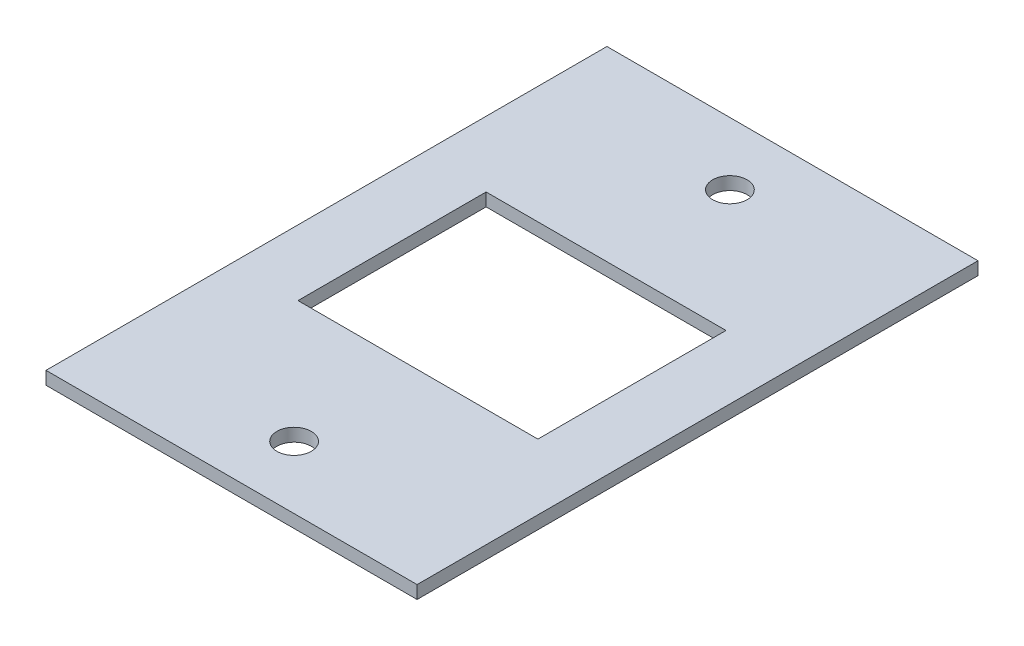
ISO-10303-21;
HEADER;
FILE_DESCRIPTION(('STEP AP214'),'2;1');
FILE_NAME('part.step','',(''),(''),'','','');
FILE_SCHEMA(('AUTOMOTIVE_DESIGN { 1 0 10303 214 1 1 1 1 }'));
ENDSEC;
DATA;
#1=APPLICATION_CONTEXT('core data for automotive mechanical design processes');
#2=APPLICATION_PROTOCOL_DEFINITION('international standard','automotive_design',2000,#1);
#3=PRODUCT_CONTEXT('',#1,'mechanical');
#4=PRODUCT('Part','Part','',(#3));
#5=PRODUCT_RELATED_PRODUCT_CATEGORY('part','',(#4));
#6=PRODUCT_DEFINITION_FORMATION('','',#4);
#7=PRODUCT_DEFINITION_CONTEXT('part definition',#1,'design');
#8=PRODUCT_DEFINITION('design','',#6,#7);
#9=PRODUCT_DEFINITION_SHAPE('','',#8);
#10=(LENGTH_UNIT() NAMED_UNIT(*) SI_UNIT(.MILLI.,.METRE.));
#11=(NAMED_UNIT(*) PLANE_ANGLE_UNIT() SI_UNIT($,.RADIAN.));
#12=(NAMED_UNIT(*) SI_UNIT($,.STERADIAN.) SOLID_ANGLE_UNIT());
#13=UNCERTAINTY_MEASURE_WITH_UNIT(LENGTH_MEASURE(1.E-05),#10,'distance_accuracy_value','');
#14=(GEOMETRIC_REPRESENTATION_CONTEXT(3) GLOBAL_UNCERTAINTY_ASSIGNED_CONTEXT((#13)) GLOBAL_UNIT_ASSIGNED_CONTEXT((#10,
#11,#12)) REPRESENTATION_CONTEXT('',''));
#15=CARTESIAN_POINT('',(0.,0.,0.));
#16=DIRECTION('',(0.,0.,1.));
#17=DIRECTION('',(1.,0.,0.));
#18=AXIS2_PLACEMENT_3D('',#15,#16,#17);
#19=CARTESIAN_POINT('',(0.,1.5,0.));
#20=DIRECTION('',(0.,-1.,0.));
#21=DIRECTION('',(0.,0.,-1.));
#22=AXIS2_PLACEMENT_3D('',#19,#20,#21);
#23=PLANE('',#22);
#24=CARTESIAN_POINT('',(21.5,1.5,-57.75));
#25=DIRECTION('',(0.,1.,0.));
#26=DIRECTION('',(0.,0.,-1.));
#27=AXIS2_PLACEMENT_3D('',#24,#25,#26);
#28=CIRCLE('',#27,2.00000000000001);
#29=CARTESIAN_POINT('',(21.5,1.5,-59.75));
#30=VERTEX_POINT('',#29);
#31=EDGE_CURVE('E153',#30,#30,#28,.T.);
#32=ORIENTED_EDGE('',*,*,#31,.F.);
#33=EDGE_LOOP('',(#32));
#34=FACE_BOUND('',#33,.T.);
#35=CARTESIAN_POINT('',(21.5,1.5,-7.25));
#36=DIRECTION('',(0.,1.,0.));
#37=DIRECTION('',(0.,0.,1.));
#38=AXIS2_PLACEMENT_3D('',#35,#36,#37);
#39=CIRCLE('',#38,2.00000000000001);
#40=CARTESIAN_POINT('',(21.5,1.5,-5.24999999999999));
#41=VERTEX_POINT('',#40);
#42=EDGE_CURVE('E161',#41,#41,#39,.T.);
#43=ORIENTED_EDGE('',*,*,#42,.F.);
#44=EDGE_LOOP('',(#43));
#45=FACE_BOUND('',#44,.T.);
#46=DIRECTION('',(0.,0.,1.));
#47=VECTOR('',#46,1.);
#48=CARTESIAN_POINT('',(0.,1.5,0.));
#49=LINE('',#48,#47);
#50=CARTESIAN_POINT('',(0.,1.5,-65.));
#51=VERTEX_POINT('',#50);
#52=CARTESIAN_POINT('',(0.,1.5,0.));
#53=VERTEX_POINT('',#52);
#54=EDGE_CURVE('E169',#51,#53,#49,.T.);
#55=ORIENTED_EDGE('',*,*,#54,.T.);
#56=DIRECTION('',(1.,0.,0.));
#57=VECTOR('',#56,1.);
#58=CARTESIAN_POINT('',(0.,1.5,0.));
#59=LINE('',#58,#57);
#60=CARTESIAN_POINT('',(43.,1.5,0.));
#61=VERTEX_POINT('',#60);
#62=EDGE_CURVE('E173',#53,#61,#59,.T.);
#63=ORIENTED_EDGE('',*,*,#62,.T.);
#64=DIRECTION('',(0.,0.,-1.));
#65=VECTOR('',#64,1.);
#66=CARTESIAN_POINT('',(43.,1.5,0.));
#67=LINE('',#66,#65);
#68=CARTESIAN_POINT('',(43.,1.5,-65.));
#69=VERTEX_POINT('',#68);
#70=EDGE_CURVE('E177',#61,#69,#67,.T.);
#71=ORIENTED_EDGE('',*,*,#70,.T.);
#72=DIRECTION('',(-1.,0.,0.));
#73=VECTOR('',#72,1.);
#74=CARTESIAN_POINT('',(0.,1.5,-65.));
#75=LINE('',#74,#73);
#76=EDGE_CURVE('E180',#69,#51,#75,.T.);
#77=ORIENTED_EDGE('',*,*,#76,.T.);
#78=EDGE_LOOP('',(#55,#63,#71,#77));
#79=FACE_BOUND('',#78,.T.);
#80=DIRECTION('',(0.,0.,-1.));
#81=VECTOR('',#80,1.);
#82=CARTESIAN_POINT('',(35.4,1.5,-43.4));
#83=LINE('',#82,#81);
#84=CARTESIAN_POINT('',(35.4,1.5,-21.6));
#85=VERTEX_POINT('',#84);
#86=CARTESIAN_POINT('',(35.4,1.5,-43.4));
#87=VERTEX_POINT('',#86);
#88=EDGE_CURVE('E105',#85,#87,#83,.T.);
#89=ORIENTED_EDGE('',*,*,#88,.F.);
#90=DIRECTION('',(1.,0.,0.));
#91=VECTOR('',#90,1.);
#92=CARTESIAN_POINT('',(7.59999999999999,1.5,-21.6));
#93=LINE('',#92,#91);
#94=CARTESIAN_POINT('',(7.59999999999999,1.5,-21.6));
#95=VERTEX_POINT('',#94);
#96=EDGE_CURVE('E131',#95,#85,#93,.T.);
#97=ORIENTED_EDGE('',*,*,#96,.F.);
#98=DIRECTION('',(0.,0.,1.));
#99=VECTOR('',#98,1.);
#100=CARTESIAN_POINT('',(7.59999999999999,1.5,-43.4));
#101=LINE('',#100,#99);
#102=CARTESIAN_POINT('',(7.59999999999999,1.5,-43.4));
#103=VERTEX_POINT('',#102);
#104=EDGE_CURVE('E127',#103,#95,#101,.T.);
#105=ORIENTED_EDGE('',*,*,#104,.F.);
#106=DIRECTION('',(-1.,0.,0.));
#107=VECTOR('',#106,1.);
#108=CARTESIAN_POINT('',(7.59999999999999,1.5,-43.4));
#109=LINE('',#108,#107);
#110=EDGE_CURVE('E114',#87,#103,#109,.T.);
#111=ORIENTED_EDGE('',*,*,#110,.F.);
#112=EDGE_LOOP('',(#89,#97,#105,#111));
#113=FACE_BOUND('',#112,.T.);
#114=ADVANCED_FACE('F39',(#34,#45,#79,#113),#23,.F.);
#115=CARTESIAN_POINT('',(0.,0.,0.));
#116=DIRECTION('',(0.,-1.,0.));
#117=DIRECTION('',(0.,0.,-1.));
#118=AXIS2_PLACEMENT_3D('',#115,#116,#117);
#119=PLANE('',#118);
#120=CARTESIAN_POINT('',(21.5,0.,-7.25));
#121=DIRECTION('',(0.,1.,0.));
#122=DIRECTION('',(0.,0.,1.));
#123=AXIS2_PLACEMENT_3D('',#120,#121,#122);
#124=CIRCLE('',#123,2.00000000000001);
#125=CARTESIAN_POINT('',(21.5,0.,-5.24999999999999));
#126=VERTEX_POINT('',#125);
#127=EDGE_CURVE('E157',#126,#126,#124,.T.);
#128=ORIENTED_EDGE('',*,*,#127,.T.);
#129=EDGE_LOOP('',(#128));
#130=FACE_BOUND('',#129,.T.);
#131=DIRECTION('',(0.,0.,1.));
#132=VECTOR('',#131,1.);
#133=CARTESIAN_POINT('',(0.,0.,0.));
#134=LINE('',#133,#132);
#135=CARTESIAN_POINT('',(0.,0.,-65.));
#136=VERTEX_POINT('',#135);
#137=CARTESIAN_POINT('',(0.,0.,0.));
#138=VERTEX_POINT('',#137);
#139=EDGE_CURVE('E165',#136,#138,#134,.T.);
#140=ORIENTED_EDGE('',*,*,#139,.F.);
#141=DIRECTION('',(-1.,0.,0.));
#142=VECTOR('',#141,1.);
#143=CARTESIAN_POINT('',(0.,0.,-65.));
#144=LINE('',#143,#142);
#145=CARTESIAN_POINT('',(43.,0.,-65.));
#146=VERTEX_POINT('',#145);
#147=EDGE_CURVE('E174',#146,#136,#144,.T.);
#148=ORIENTED_EDGE('',*,*,#147,.F.);
#149=DIRECTION('',(0.,0.,-1.));
#150=VECTOR('',#149,1.);
#151=CARTESIAN_POINT('',(43.,0.,0.));
#152=LINE('',#151,#150);
#153=CARTESIAN_POINT('',(43.,0.,0.));
#154=VERTEX_POINT('',#153);
#155=EDGE_CURVE('E190',#154,#146,#152,.T.);
#156=ORIENTED_EDGE('',*,*,#155,.F.);
#157=DIRECTION('',(1.,0.,0.));
#158=VECTOR('',#157,1.);
#159=CARTESIAN_POINT('',(0.,0.,0.));
#160=LINE('',#159,#158);
#161=EDGE_CURVE('E187',#138,#154,#160,.T.);
#162=ORIENTED_EDGE('',*,*,#161,.F.);
#163=EDGE_LOOP('',(#140,#148,#156,#162));
#164=FACE_BOUND('',#163,.T.);
#165=CARTESIAN_POINT('',(21.5,0.,-57.75));
#166=DIRECTION('',(0.,1.,0.));
#167=DIRECTION('',(0.,0.,-1.));
#168=AXIS2_PLACEMENT_3D('',#165,#166,#167);
#169=CIRCLE('',#168,2.00000000000001);
#170=CARTESIAN_POINT('',(21.5,0.,-59.75));
#171=VERTEX_POINT('',#170);
#172=EDGE_CURVE('E123',#171,#171,#169,.T.);
#173=ORIENTED_EDGE('',*,*,#172,.T.);
#174=EDGE_LOOP('',(#173));
#175=FACE_BOUND('',#174,.T.);
#176=DIRECTION('',(1.,0.,0.));
#177=VECTOR('',#176,1.);
#178=CARTESIAN_POINT('',(7.59999999999999,0.,-21.6));
#179=LINE('',#178,#177);
#180=CARTESIAN_POINT('',(7.59999999999999,0.,-21.6));
#181=VERTEX_POINT('',#180);
#182=CARTESIAN_POINT('',(35.4,0.,-21.6));
#183=VERTEX_POINT('',#182);
#184=EDGE_CURVE('E115',#181,#183,#179,.T.);
#185=ORIENTED_EDGE('',*,*,#184,.T.);
#186=DIRECTION('',(0.,0.,-1.));
#187=VECTOR('',#186,1.);
#188=CARTESIAN_POINT('',(35.4,0.,-43.4));
#189=LINE('',#188,#187);
#190=CARTESIAN_POINT('',(35.4,0.,-43.4));
#191=VERTEX_POINT('',#190);
#192=EDGE_CURVE('E63',#183,#191,#189,.T.);
#193=ORIENTED_EDGE('',*,*,#192,.T.);
#194=DIRECTION('',(-1.,0.,0.));
#195=VECTOR('',#194,1.);
#196=CARTESIAN_POINT('',(7.59999999999999,0.,-43.4));
#197=LINE('',#196,#195);
#198=CARTESIAN_POINT('',(7.59999999999999,0.,-43.4));
#199=VERTEX_POINT('',#198);
#200=EDGE_CURVE('E121',#191,#199,#197,.T.);
#201=ORIENTED_EDGE('',*,*,#200,.T.);
#202=DIRECTION('',(0.,0.,1.));
#203=VECTOR('',#202,1.);
#204=CARTESIAN_POINT('',(7.59999999999999,0.,-43.4));
#205=LINE('',#204,#203);
#206=EDGE_CURVE('E140',#199,#181,#205,.T.);
#207=ORIENTED_EDGE('',*,*,#206,.T.);
#208=EDGE_LOOP('',(#185,#193,#201,#207));
#209=FACE_BOUND('',#208,.T.);
#210=ADVANCED_FACE('F213',(#130,#164,#175,#209),#119,.T.);
#211=CARTESIAN_POINT('',(0.,1.5,0.));
#212=DIRECTION('',(1.,0.,0.));
#213=DIRECTION('',(0.,0.,-1.));
#214=AXIS2_PLACEMENT_3D('',#211,#212,#213);
#215=PLANE('',#214);
#216=ORIENTED_EDGE('',*,*,#139,.T.);
#217=DIRECTION('',(0.,-1.,0.));
#218=VECTOR('',#217,1.);
#219=CARTESIAN_POINT('',(0.,1.5,0.));
#220=LINE('',#219,#218);
#221=EDGE_CURVE('E11',#53,#138,#220,.T.);
#222=ORIENTED_EDGE('',*,*,#221,.F.);
#223=ORIENTED_EDGE('',*,*,#54,.F.);
#224=DIRECTION('',(0.,-1.,0.));
#225=VECTOR('',#224,1.);
#226=CARTESIAN_POINT('',(0.,1.5,-65.));
#227=LINE('',#226,#225);
#228=EDGE_CURVE('E183',#51,#136,#227,.T.);
#229=ORIENTED_EDGE('',*,*,#228,.T.);
#230=EDGE_LOOP('',(#216,#222,#223,#229));
#231=FACE_BOUND('',#230,.T.);
#232=ADVANCED_FACE('F41',(#231),#215,.F.);
#233=CARTESIAN_POINT('',(0.,1.5,0.));
#234=DIRECTION('',(0.,0.,-1.));
#235=DIRECTION('',(-1.,0.,0.));
#236=AXIS2_PLACEMENT_3D('',#233,#234,#235);
#237=PLANE('',#236);
#238=ORIENTED_EDGE('',*,*,#161,.T.);
#239=DIRECTION('',(0.,-1.,0.));
#240=VECTOR('',#239,1.);
#241=CARTESIAN_POINT('',(43.,1.5,0.));
#242=LINE('',#241,#240);
#243=EDGE_CURVE('E48',#61,#154,#242,.T.);
#244=ORIENTED_EDGE('',*,*,#243,.F.);
#245=ORIENTED_EDGE('',*,*,#62,.F.);
#246=ORIENTED_EDGE('',*,*,#221,.T.);
#247=EDGE_LOOP('',(#238,#244,#245,#246));
#248=FACE_BOUND('',#247,.T.);
#249=ADVANCED_FACE('F223',(#248),#237,.F.);
#250=CARTESIAN_POINT('',(43.,1.5,0.));
#251=DIRECTION('',(-1.,0.,0.));
#252=DIRECTION('',(0.,0.,1.));
#253=AXIS2_PLACEMENT_3D('',#250,#251,#252);
#254=PLANE('',#253);
#255=ORIENTED_EDGE('',*,*,#155,.T.);
#256=DIRECTION('',(0.,-1.,0.));
#257=VECTOR('',#256,1.);
#258=CARTESIAN_POINT('',(43.,1.5,-65.));
#259=LINE('',#258,#257);
#260=EDGE_CURVE('E198',#69,#146,#259,.T.);
#261=ORIENTED_EDGE('',*,*,#260,.F.);
#262=ORIENTED_EDGE('',*,*,#70,.F.);
#263=ORIENTED_EDGE('',*,*,#243,.T.);
#264=EDGE_LOOP('',(#255,#261,#262,#263));
#265=FACE_BOUND('',#264,.T.);
#266=ADVANCED_FACE('F207',(#265),#254,.F.);
#267=CARTESIAN_POINT('',(0.,1.5,-65.));
#268=DIRECTION('',(0.,0.,1.));
#269=DIRECTION('',(1.,0.,0.));
#270=AXIS2_PLACEMENT_3D('',#267,#268,#269);
#271=PLANE('',#270);
#272=ORIENTED_EDGE('',*,*,#147,.T.);
#273=ORIENTED_EDGE('',*,*,#228,.F.);
#274=ORIENTED_EDGE('',*,*,#76,.F.);
#275=ORIENTED_EDGE('',*,*,#260,.T.);
#276=EDGE_LOOP('',(#272,#273,#274,#275));
#277=FACE_BOUND('',#276,.T.);
#278=ADVANCED_FACE('F217',(#277),#271,.F.);
#279=CARTESIAN_POINT('',(21.5,1.5,-7.25));
#280=DIRECTION('',(0.,-1.,0.));
#281=DIRECTION('',(0.,0.,-1.));
#282=AXIS2_PLACEMENT_3D('',#279,#280,#281);
#283=CYLINDRICAL_SURFACE('',#282,2.00000000000001);
#284=ORIENTED_EDGE('',*,*,#42,.T.);
#285=EDGE_LOOP('',(#284));
#286=FACE_BOUND('',#285,.T.);
#287=ORIENTED_EDGE('',*,*,#127,.F.);
#288=EDGE_LOOP('',(#287));
#289=FACE_BOUND('',#288,.T.);
#290=ADVANCED_FACE('F241',(#286,#289),#283,.F.);
#291=CARTESIAN_POINT('',(21.5,1.5,-57.75));
#292=DIRECTION('',(0.,-1.,0.));
#293=DIRECTION('',(0.,0.,-1.));
#294=AXIS2_PLACEMENT_3D('',#291,#292,#293);
#295=CYLINDRICAL_SURFACE('',#294,2.00000000000001);
#296=ORIENTED_EDGE('',*,*,#31,.T.);
#297=EDGE_LOOP('',(#296));
#298=FACE_BOUND('',#297,.T.);
#299=ORIENTED_EDGE('',*,*,#172,.F.);
#300=EDGE_LOOP('',(#299));
#301=FACE_BOUND('',#300,.T.);
#302=ADVANCED_FACE('F248',(#298,#301),#295,.F.);
#303=CARTESIAN_POINT('',(35.4,1.5,-43.4));
#304=DIRECTION('',(-1.,0.,0.));
#305=DIRECTION('',(0.,0.,1.));
#306=AXIS2_PLACEMENT_3D('',#303,#304,#305);
#307=PLANE('',#306);
#308=ORIENTED_EDGE('',*,*,#192,.F.);
#309=DIRECTION('',(0.,-1.,0.));
#310=VECTOR('',#309,1.);
#311=CARTESIAN_POINT('',(35.4,1.5,-21.6));
#312=LINE('',#311,#310);
#313=EDGE_CURVE('E109',#85,#183,#312,.T.);
#314=ORIENTED_EDGE('',*,*,#313,.F.);
#315=ORIENTED_EDGE('',*,*,#88,.T.);
#316=DIRECTION('',(0.,-1.,0.));
#317=VECTOR('',#316,1.);
#318=CARTESIAN_POINT('',(35.4,1.5,-43.4));
#319=LINE('',#318,#317);
#320=EDGE_CURVE('E108',#87,#191,#319,.T.);
#321=ORIENTED_EDGE('',*,*,#320,.T.);
#322=EDGE_LOOP('',(#308,#314,#315,#321));
#323=FACE_BOUND('',#322,.T.);
#324=ADVANCED_FACE('F107',(#323),#307,.T.);
#325=CARTESIAN_POINT('',(7.59999999999999,1.5,-43.4));
#326=DIRECTION('',(0.,0.,1.));
#327=DIRECTION('',(1.,0.,0.));
#328=AXIS2_PLACEMENT_3D('',#325,#326,#327);
#329=PLANE('',#328);
#330=ORIENTED_EDGE('',*,*,#200,.F.);
#331=ORIENTED_EDGE('',*,*,#320,.F.);
#332=ORIENTED_EDGE('',*,*,#110,.T.);
#333=DIRECTION('',(0.,-1.,0.));
#334=VECTOR('',#333,1.);
#335=CARTESIAN_POINT('',(7.59999999999999,1.5,-43.4));
#336=LINE('',#335,#334);
#337=EDGE_CURVE('E124',#103,#199,#336,.T.);
#338=ORIENTED_EDGE('',*,*,#337,.T.);
#339=EDGE_LOOP('',(#330,#331,#332,#338));
#340=FACE_BOUND('',#339,.T.);
#341=ADVANCED_FACE('F118',(#340),#329,.T.);
#342=CARTESIAN_POINT('',(7.59999999999999,1.5,-43.4));
#343=DIRECTION('',(1.,0.,0.));
#344=DIRECTION('',(0.,0.,-1.));
#345=AXIS2_PLACEMENT_3D('',#342,#343,#344);
#346=PLANE('',#345);
#347=ORIENTED_EDGE('',*,*,#206,.F.);
#348=ORIENTED_EDGE('',*,*,#337,.F.);
#349=ORIENTED_EDGE('',*,*,#104,.T.);
#350=DIRECTION('',(0.,-1.,0.));
#351=VECTOR('',#350,1.);
#352=CARTESIAN_POINT('',(7.59999999999999,1.5,-21.6));
#353=LINE('',#352,#351);
#354=EDGE_CURVE('E55',#95,#181,#353,.T.);
#355=ORIENTED_EDGE('',*,*,#354,.T.);
#356=EDGE_LOOP('',(#347,#348,#349,#355));
#357=FACE_BOUND('',#356,.T.);
#358=ADVANCED_FACE('F265',(#357),#346,.T.);
#359=CARTESIAN_POINT('',(7.59999999999999,1.5,-21.6));
#360=DIRECTION('',(0.,0.,-1.));
#361=DIRECTION('',(-1.,0.,0.));
#362=AXIS2_PLACEMENT_3D('',#359,#360,#361);
#363=PLANE('',#362);
#364=ORIENTED_EDGE('',*,*,#184,.F.);
#365=ORIENTED_EDGE('',*,*,#354,.F.);
#366=ORIENTED_EDGE('',*,*,#96,.T.);
#367=ORIENTED_EDGE('',*,*,#313,.T.);
#368=EDGE_LOOP('',(#364,#365,#366,#367));
#369=FACE_BOUND('',#368,.T.);
#370=ADVANCED_FACE('F268',(#369),#363,.T.);
#371=CLOSED_SHELL('',(#114,#210,#232,#249,#266,#278,#290,#302,#324,#341,#358,#370));
#372=MANIFOLD_SOLID_BREP('B2',#371);
#373=ADVANCED_BREP_SHAPE_REPRESENTATION('',(#18,#372),#14);
#374=SHAPE_DEFINITION_REPRESENTATION(#9,#373);
ENDSEC;
END-ISO-10303-21;
